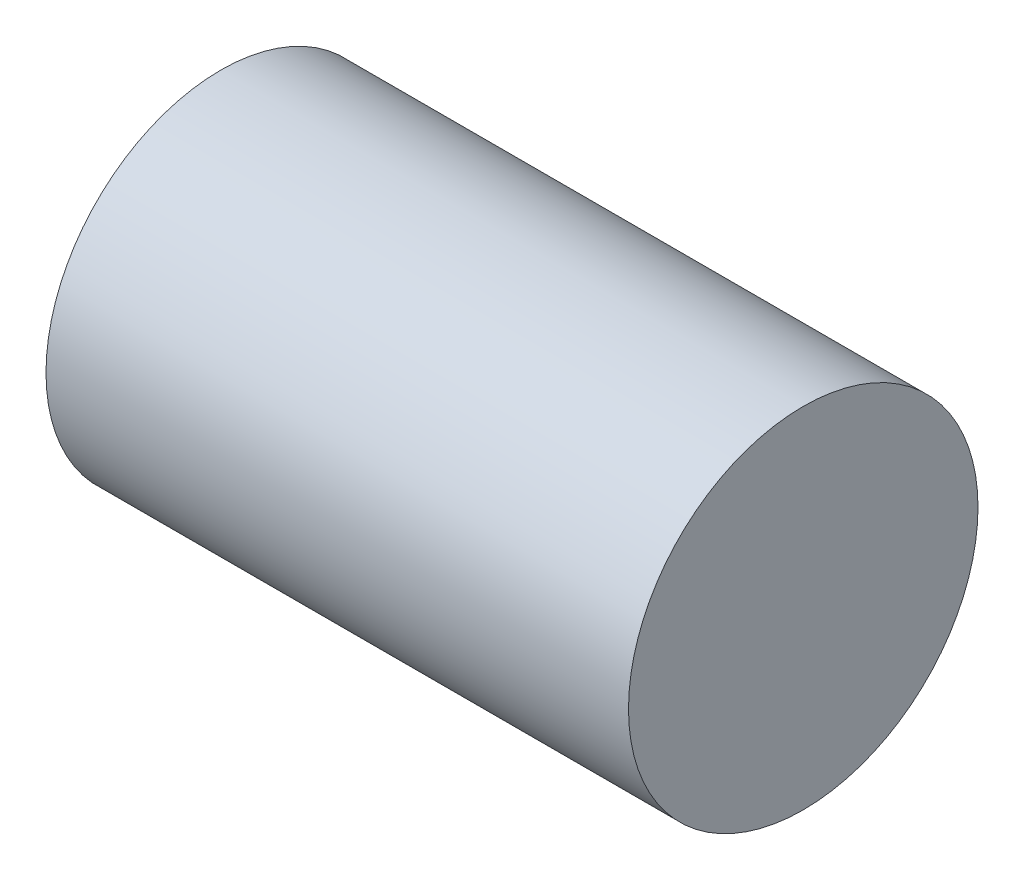
ISO-10303-21;
HEADER;
FILE_DESCRIPTION(('STEP AP214'),'2;1');
FILE_NAME('part.step','',(''),(''),'','','');
FILE_SCHEMA(('AUTOMOTIVE_DESIGN { 1 0 10303 214 1 1 1 1 }'));
ENDSEC;
DATA;
#1=APPLICATION_CONTEXT('core data for automotive mechanical design processes');
#2=APPLICATION_PROTOCOL_DEFINITION('international standard','automotive_design',2000,#1);
#3=PRODUCT_CONTEXT('',#1,'mechanical');
#4=PRODUCT('Part','Part','',(#3));
#5=PRODUCT_RELATED_PRODUCT_CATEGORY('part','',(#4));
#6=PRODUCT_DEFINITION_FORMATION('','',#4);
#7=PRODUCT_DEFINITION_CONTEXT('part definition',#1,'design');
#8=PRODUCT_DEFINITION('design','',#6,#7);
#9=PRODUCT_DEFINITION_SHAPE('','',#8);
#10=(LENGTH_UNIT() NAMED_UNIT(*) SI_UNIT(.MILLI.,.METRE.));
#11=(NAMED_UNIT(*) PLANE_ANGLE_UNIT() SI_UNIT($,.RADIAN.));
#12=(NAMED_UNIT(*) SI_UNIT($,.STERADIAN.) SOLID_ANGLE_UNIT());
#13=UNCERTAINTY_MEASURE_WITH_UNIT(LENGTH_MEASURE(1.E-05),#10,'distance_accuracy_value','');
#14=(GEOMETRIC_REPRESENTATION_CONTEXT(3) GLOBAL_UNCERTAINTY_ASSIGNED_CONTEXT((#13)) GLOBAL_UNIT_ASSIGNED_CONTEXT((#10,
#11,#12)) REPRESENTATION_CONTEXT('',''));
#15=CARTESIAN_POINT('',(0.,0.,0.));
#16=DIRECTION('',(0.,0.,1.));
#17=DIRECTION('',(1.,0.,0.));
#18=AXIS2_PLACEMENT_3D('',#15,#16,#17);
#19=CARTESIAN_POINT('',(-27.9999999999995,2.1094237467878E-12,1.66533453693773E-13));
#20=DIRECTION('',(-1.,0.,0.));
#21=DIRECTION('',(0.,0.,0.999999999999996));
#22=AXIS2_PLACEMENT_3D('',#19,#20,#21);
#23=CYLINDRICAL_SURFACE('',#22,4.);
#24=CARTESIAN_POINT('',(17.0000000000004,3.88578058618805E-13,2.22044604925031E-13));
#25=DIRECTION('',(-1.,0.,0.));
#26=DIRECTION('',(0.,0.,0.999999999999996));
#27=AXIS2_PLACEMENT_3D('',#24,#25,#26);
#28=CIRCLE('',#27,4.);
#29=CARTESIAN_POINT('',(17.0000000000004,3.8860581419442E-13,4.00000000000021));
#30=VERTEX_POINT('',#29);
#31=EDGE_CURVE('E51',#30,#30,#28,.T.);
#32=ORIENTED_EDGE('',*,*,#31,.F.);
#33=EDGE_LOOP('',(#32));
#34=FACE_BOUND('',#33,.T.);
#35=CARTESIAN_POINT('',(1.94289029309402E-13,2.22044604925031E-13,2.22044604925031E-13));
#36=DIRECTION('',(-1.,0.,0.));
#37=DIRECTION('',(0.,0.,0.999999999999996));
#38=AXIS2_PLACEMENT_3D('',#35,#36,#37);
#39=CIRCLE('',#38,4.);
#40=CARTESIAN_POINT('',(1.97619698383278E-13,2.22072360500647E-13,4.00000000000021));
#41=VERTEX_POINT('',#40);
#42=EDGE_CURVE('E10',#41,#41,#39,.T.);
#43=ORIENTED_EDGE('',*,*,#42,.T.);
#44=EDGE_LOOP('',(#43));
#45=FACE_BOUND('',#44,.T.);
#46=ADVANCED_FACE('F37',(#34,#45),#23,.F.);
#47=CARTESIAN_POINT('',(4.71844785465692E-13,4.00000000000011,1.38777878078145E-13));
#48=DIRECTION('',(1.,0.,0.));
#49=DIRECTION('',(0.,0.,-0.999999999999996));
#50=AXIS2_PLACEMENT_3D('',#47,#48,#49);
#51=PLANE('',#50);
#52=ORIENTED_EDGE('',*,*,#42,.F.);
#53=EDGE_LOOP('',(#52));
#54=FACE_BOUND('',#53,.T.);
#55=CARTESIAN_POINT('',(1.94289029309402E-13,2.22044604925031E-13,2.22044604925031E-13));
#56=DIRECTION('',(-1.,0.,0.));
#57=DIRECTION('',(0.,0.,0.999999999999996));
#58=AXIS2_PLACEMENT_3D('',#55,#56,#57);
#59=CIRCLE('',#58,6.);
#60=CARTESIAN_POINT('',(1.99285032920216E-13,2.22086238288455E-13,6.0000000000002));
#61=VERTEX_POINT('',#60);
#62=EDGE_CURVE('E43',#61,#61,#59,.T.);
#63=ORIENTED_EDGE('',*,*,#62,.T.);
#64=EDGE_LOOP('',(#63));
#65=FACE_BOUND('',#64,.T.);
#66=ADVANCED_FACE('F60',(#54,#65),#51,.F.);
#67=CARTESIAN_POINT('',(-27.9999999999995,2.1094237467878E-12,1.66533453693773E-13));
#68=DIRECTION('',(-1.,0.,0.));
#69=DIRECTION('',(0.,0.,0.999999999999996));
#70=AXIS2_PLACEMENT_3D('',#67,#68,#69);
#71=CYLINDRICAL_SURFACE('',#70,6.);
#72=ORIENTED_EDGE('',*,*,#62,.F.);
#73=EDGE_LOOP('',(#72));
#74=FACE_BOUND('',#73,.T.);
#75=CARTESIAN_POINT('',(20.0000000000003,-2.22044604925031E-13,1.11022302462516E-13));
#76=DIRECTION('',(-1.,0.,0.));
#77=DIRECTION('',(0.,0.,0.999999999999996));
#78=AXIS2_PLACEMENT_3D('',#75,#76,#77);
#79=CIRCLE('',#78,6.);
#80=CARTESIAN_POINT('',(20.0000000000003,-2.22002971561608E-13,6.00000000000009));
#81=VERTEX_POINT('',#80);
#82=EDGE_CURVE('E47',#81,#81,#79,.T.);
#83=ORIENTED_EDGE('',*,*,#82,.T.);
#84=EDGE_LOOP('',(#83));
#85=FACE_BOUND('',#84,.T.);
#86=ADVANCED_FACE('F64',(#74,#85),#71,.T.);
#87=CARTESIAN_POINT('',(20.0000000000004,5.99999999999984,0.));
#88=DIRECTION('',(-1.,0.,0.));
#89=DIRECTION('',(0.,0.,0.999999999999996));
#90=AXIS2_PLACEMENT_3D('',#87,#88,#89);
#91=PLANE('',#90);
#92=ORIENTED_EDGE('',*,*,#82,.F.);
#93=EDGE_LOOP('',(#92));
#94=FACE_BOUND('',#93,.T.);
#95=ADVANCED_FACE('F69',(#94),#91,.F.);
#96=CARTESIAN_POINT('',(17.0000000000004,3.88578058618805E-13,2.22044604925031E-13));
#97=DIRECTION('',(1.,0.,0.));
#98=DIRECTION('',(0.,0.,-0.999999999999996));
#99=AXIS2_PLACEMENT_3D('',#96,#97,#98);
#100=PLANE('',#99);
#101=ORIENTED_EDGE('',*,*,#31,.T.);
#102=EDGE_LOOP('',(#101));
#103=FACE_BOUND('',#102,.T.);
#104=ADVANCED_FACE('F57',(#103),#100,.F.);
#105=CLOSED_SHELL('',(#46,#66,#86,#95,#104));
#106=MANIFOLD_SOLID_BREP('B2',#105);
#107=ADVANCED_BREP_SHAPE_REPRESENTATION('',(#18,#106),#14);
#108=SHAPE_DEFINITION_REPRESENTATION(#9,#107);
ENDSEC;
END-ISO-10303-21;
